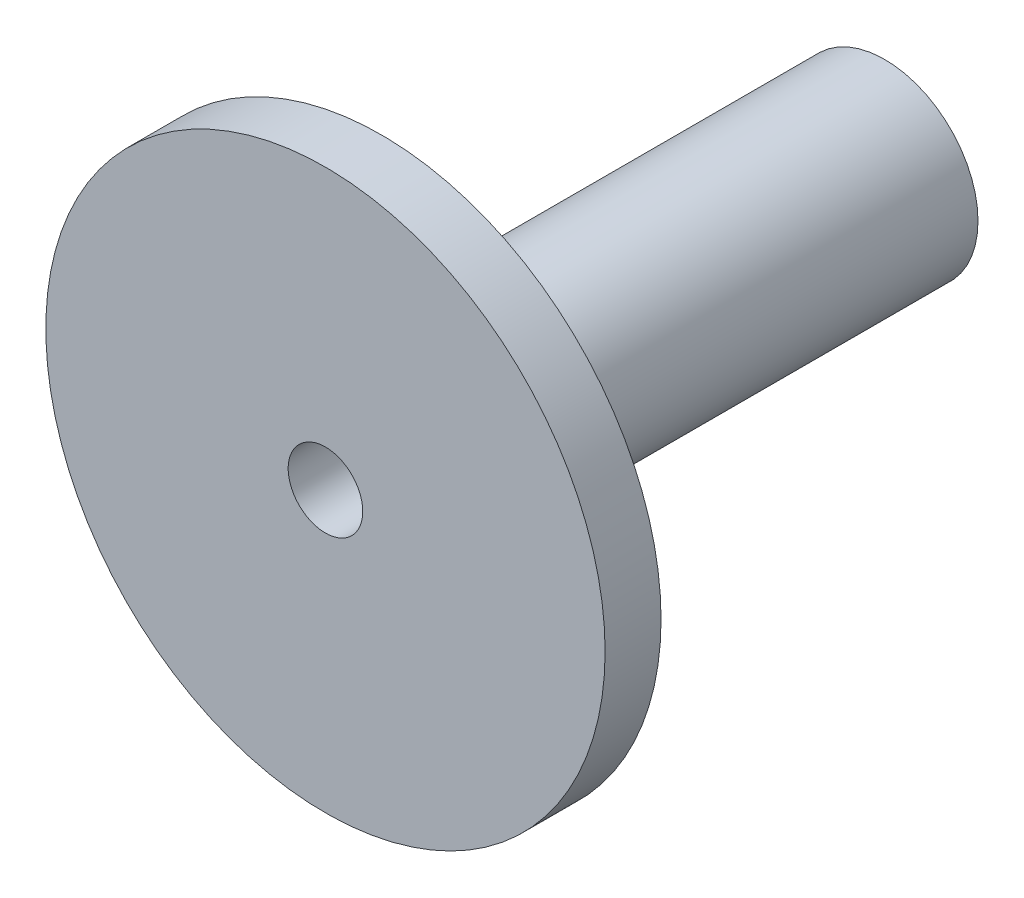
ISO-10303-21;
HEADER;
FILE_DESCRIPTION(('STEP AP214'),'2;1');
FILE_NAME('part.step','',(''),(''),'','','');
FILE_SCHEMA(('AUTOMOTIVE_DESIGN { 1 0 10303 214 1 1 1 1 }'));
ENDSEC;
DATA;
#1=APPLICATION_CONTEXT('core data for automotive mechanical design processes');
#2=APPLICATION_PROTOCOL_DEFINITION('international standard','automotive_design',2000,#1);
#3=PRODUCT_CONTEXT('',#1,'mechanical');
#4=PRODUCT('Part','Part','',(#3));
#5=PRODUCT_RELATED_PRODUCT_CATEGORY('part','',(#4));
#6=PRODUCT_DEFINITION_FORMATION('','',#4);
#7=PRODUCT_DEFINITION_CONTEXT('part definition',#1,'design');
#8=PRODUCT_DEFINITION('design','',#6,#7);
#9=PRODUCT_DEFINITION_SHAPE('','',#8);
#10=(LENGTH_UNIT() NAMED_UNIT(*) SI_UNIT(.MILLI.,.METRE.));
#11=(NAMED_UNIT(*) PLANE_ANGLE_UNIT() SI_UNIT($,.RADIAN.));
#12=(NAMED_UNIT(*) SI_UNIT($,.STERADIAN.) SOLID_ANGLE_UNIT());
#13=UNCERTAINTY_MEASURE_WITH_UNIT(LENGTH_MEASURE(1.E-05),#10,'distance_accuracy_value','');
#14=(GEOMETRIC_REPRESENTATION_CONTEXT(3) GLOBAL_UNCERTAINTY_ASSIGNED_CONTEXT((#13)) GLOBAL_UNIT_ASSIGNED_CONTEXT((#10,
#11,#12)) REPRESENTATION_CONTEXT('',''));
#15=CARTESIAN_POINT('',(0.,0.,0.));
#16=DIRECTION('',(0.,0.,1.));
#17=DIRECTION('',(1.,0.,0.));
#18=AXIS2_PLACEMENT_3D('',#15,#16,#17);
#19=CARTESIAN_POINT('',(0.,0.,30.));
#20=DIRECTION('',(0.,0.,-1.));
#21=DIRECTION('',(-1.,0.,0.));
#22=AXIS2_PLACEMENT_3D('',#19,#20,#21);
#23=CYLINDRICAL_SURFACE('',#22,5.);
#24=CARTESIAN_POINT('',(0.,0.,0.));
#25=DIRECTION('',(0.,0.,1.));
#26=DIRECTION('',(1.,0.,0.));
#27=AXIS2_PLACEMENT_3D('',#24,#25,#26);
#28=CIRCLE('',#27,5.);
#29=CARTESIAN_POINT('',(5.,0.,0.));
#30=VERTEX_POINT('',#29);
#31=EDGE_CURVE('E41',#30,#30,#28,.T.);
#32=ORIENTED_EDGE('',*,*,#31,.T.);
#33=EDGE_LOOP('',(#32));
#34=FACE_BOUND('',#33,.T.);
#35=CARTESIAN_POINT('',(0.,0.,27.));
#36=DIRECTION('',(0.,0.,1.));
#37=DIRECTION('',(1.,0.,0.));
#38=AXIS2_PLACEMENT_3D('',#35,#36,#37);
#39=CIRCLE('',#38,5.);
#40=CARTESIAN_POINT('',(5.,0.,27.));
#41=VERTEX_POINT('',#40);
#42=EDGE_CURVE('E10',#41,#41,#39,.T.);
#43=ORIENTED_EDGE('',*,*,#42,.F.);
#44=EDGE_LOOP('',(#43));
#45=FACE_BOUND('',#44,.T.);
#46=ADVANCED_FACE('F35',(#34,#45),#23,.T.);
#47=CARTESIAN_POINT('',(0.,0.,30.));
#48=DIRECTION('',(0.,0.,1.));
#49=DIRECTION('',(1.,0.,0.));
#50=AXIS2_PLACEMENT_3D('',#47,#48,#49);
#51=PLANE('',#50);
#52=CARTESIAN_POINT('',(0.,0.,30.));
#53=DIRECTION('',(0.,0.,1.));
#54=DIRECTION('',(1.,0.,0.));
#55=AXIS2_PLACEMENT_3D('',#52,#53,#54);
#56=CIRCLE('',#55,2.);
#57=CARTESIAN_POINT('',(2.,0.,30.));
#58=VERTEX_POINT('',#57);
#59=EDGE_CURVE('E49',#58,#58,#56,.T.);
#60=ORIENTED_EDGE('',*,*,#59,.F.);
#61=EDGE_LOOP('',(#60));
#62=FACE_BOUND('',#61,.T.);
#63=CARTESIAN_POINT('',(0.,0.,30.));
#64=DIRECTION('',(0.,0.,1.));
#65=DIRECTION('',(1.,0.,0.));
#66=AXIS2_PLACEMENT_3D('',#63,#64,#65);
#67=CIRCLE('',#66,15.);
#68=CARTESIAN_POINT('',(15.,0.,30.));
#69=VERTEX_POINT('',#68);
#70=EDGE_CURVE('E55',#69,#69,#67,.T.);
#71=ORIENTED_EDGE('',*,*,#70,.T.);
#72=EDGE_LOOP('',(#71));
#73=FACE_BOUND('',#72,.T.);
#74=ADVANCED_FACE('F73',(#62,#73),#51,.T.);
#75=CARTESIAN_POINT('',(0.,0.,0.));
#76=DIRECTION('',(0.,0.,1.));
#77=DIRECTION('',(1.,0.,0.));
#78=AXIS2_PLACEMENT_3D('',#75,#76,#77);
#79=PLANE('',#78);
#80=CARTESIAN_POINT('',(0.,0.,0.));
#81=DIRECTION('',(0.,0.,1.));
#82=DIRECTION('',(1.,0.,0.));
#83=AXIS2_PLACEMENT_3D('',#80,#81,#82);
#84=CIRCLE('',#83,2.);
#85=CARTESIAN_POINT('',(2.,0.,0.));
#86=VERTEX_POINT('',#85);
#87=EDGE_CURVE('E45',#86,#86,#84,.T.);
#88=ORIENTED_EDGE('',*,*,#87,.T.);
#89=EDGE_LOOP('',(#88));
#90=FACE_BOUND('',#89,.T.);
#91=ORIENTED_EDGE('',*,*,#31,.F.);
#92=EDGE_LOOP('',(#91));
#93=FACE_BOUND('',#92,.T.);
#94=ADVANCED_FACE('F77',(#90,#93),#79,.F.);
#95=CARTESIAN_POINT('',(0.,0.,0.));
#96=DIRECTION('',(0.,0.,1.));
#97=DIRECTION('',(1.,0.,0.));
#98=AXIS2_PLACEMENT_3D('',#95,#96,#97);
#99=CYLINDRICAL_SURFACE('',#98,2.);
#100=ORIENTED_EDGE('',*,*,#87,.F.);
#101=EDGE_LOOP('',(#100));
#102=FACE_BOUND('',#101,.T.);
#103=ORIENTED_EDGE('',*,*,#59,.T.);
#104=EDGE_LOOP('',(#103));
#105=FACE_BOUND('',#104,.T.);
#106=ADVANCED_FACE('F70',(#102,#105),#99,.F.);
#107=CARTESIAN_POINT('',(0.,0.,27.));
#108=DIRECTION('',(0.,0.,1.));
#109=DIRECTION('',(1.,0.,0.));
#110=AXIS2_PLACEMENT_3D('',#107,#108,#109);
#111=CYLINDRICAL_SURFACE('',#110,15.);
#112=CARTESIAN_POINT('',(0.,0.,27.));
#113=DIRECTION('',(0.,0.,1.));
#114=DIRECTION('',(1.,0.,0.));
#115=AXIS2_PLACEMENT_3D('',#112,#113,#114);
#116=CIRCLE('',#115,15.);
#117=CARTESIAN_POINT('',(15.,0.,27.));
#118=VERTEX_POINT('',#117);
#119=EDGE_CURVE('E53',#118,#118,#116,.T.);
#120=ORIENTED_EDGE('',*,*,#119,.T.);
#121=EDGE_LOOP('',(#120));
#122=FACE_BOUND('',#121,.T.);
#123=ORIENTED_EDGE('',*,*,#70,.F.);
#124=EDGE_LOOP('',(#123));
#125=FACE_BOUND('',#124,.T.);
#126=ADVANCED_FACE('F61',(#122,#125),#111,.T.);
#127=CARTESIAN_POINT('',(0.,0.,27.));
#128=DIRECTION('',(0.,0.,1.));
#129=DIRECTION('',(1.,0.,0.));
#130=AXIS2_PLACEMENT_3D('',#127,#128,#129);
#131=PLANE('',#130);
#132=ORIENTED_EDGE('',*,*,#42,.T.);
#133=EDGE_LOOP('',(#132));
#134=FACE_BOUND('',#133,.T.);
#135=ORIENTED_EDGE('',*,*,#119,.F.);
#136=EDGE_LOOP('',(#135));
#137=FACE_BOUND('',#136,.T.);
#138=ADVANCED_FACE('F64',(#134,#137),#131,.F.);
#139=CLOSED_SHELL('',(#46,#74,#94,#106,#126,#138));
#140=MANIFOLD_SOLID_BREP('B2',#139);
#141=ADVANCED_BREP_SHAPE_REPRESENTATION('',(#18,#140),#14);
#142=SHAPE_DEFINITION_REPRESENTATION(#9,#141);
ENDSEC;
END-ISO-10303-21;
